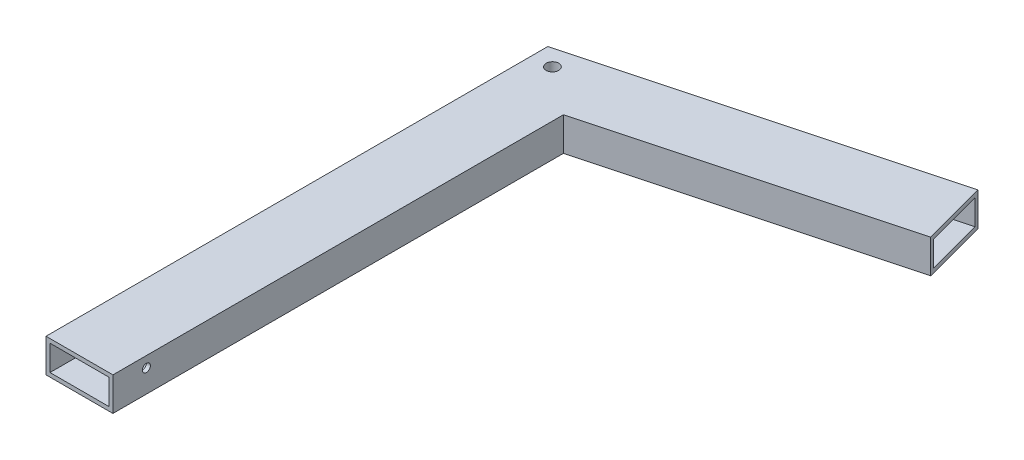
ISO-10303-21;
HEADER;
FILE_DESCRIPTION(('STEP AP214'),'2;1');
FILE_NAME('part.step','',(''),(''),'','','');
FILE_SCHEMA(('AUTOMOTIVE_DESIGN { 1 0 10303 214 1 1 1 1 }'));
ENDSEC;
DATA;
#1=APPLICATION_CONTEXT('core data for automotive mechanical design processes');
#2=APPLICATION_PROTOCOL_DEFINITION('international standard','automotive_design',2000,#1);
#3=PRODUCT_CONTEXT('',#1,'mechanical');
#4=PRODUCT('Part','Part','',(#3));
#5=PRODUCT_RELATED_PRODUCT_CATEGORY('part','',(#4));
#6=PRODUCT_DEFINITION_FORMATION('','',#4);
#7=PRODUCT_DEFINITION_CONTEXT('part definition',#1,'design');
#8=PRODUCT_DEFINITION('design','',#6,#7);
#9=PRODUCT_DEFINITION_SHAPE('','',#8);
#10=(LENGTH_UNIT() NAMED_UNIT(*) SI_UNIT(.MILLI.,.METRE.));
#11=(NAMED_UNIT(*) PLANE_ANGLE_UNIT() SI_UNIT($,.RADIAN.));
#12=(NAMED_UNIT(*) SI_UNIT($,.STERADIAN.) SOLID_ANGLE_UNIT());
#13=UNCERTAINTY_MEASURE_WITH_UNIT(LENGTH_MEASURE(1.E-05),#10,'distance_accuracy_value','');
#14=(GEOMETRIC_REPRESENTATION_CONTEXT(3) GLOBAL_UNCERTAINTY_ASSIGNED_CONTEXT((#13)) GLOBAL_UNIT_ASSIGNED_CONTEXT((#10,
#11,#12)) REPRESENTATION_CONTEXT('',''));
#15=CARTESIAN_POINT('',(0.,0.,0.));
#16=DIRECTION('',(0.,0.,1.));
#17=DIRECTION('',(1.,0.,0.));
#18=AXIS2_PLACEMENT_3D('',#15,#16,#17);
#19=CARTESIAN_POINT('',(-351.987582128705,25.4,-259.527039328841));
#20=DIRECTION('',(-0.965925826289069,0.,0.258819045102517));
#21=DIRECTION('',(-0.258819045102517,0.,-0.965925826289069));
#22=AXIS2_PLACEMENT_3D('',#19,#20,#21);
#23=PLANE('',#22);
#24=DIRECTION('',(0.,-1.,0.));
#25=VECTOR('',#24,1.);
#26=CARTESIAN_POINT('',(-339.628455086968,22.352,-213.40214927188));
#27=LINE('',#26,#25);
#28=CARTESIAN_POINT('',(-339.628455086968,22.352,-213.40214927188));
#29=VERTEX_POINT('',#28);
#30=CARTESIAN_POINT('',(-339.628455086968,3.048,-213.40214927188));
#31=VERTEX_POINT('',#30);
#32=EDGE_CURVE('E168',#29,#31,#27,.T.);
#33=ORIENTED_EDGE('',*,*,#32,.F.);
#34=DIRECTION('',(0.258819045102517,0.,0.965925826289069));
#35=VECTOR('',#34,1.);
#36=CARTESIAN_POINT('',(-351.198701679231,22.352,-256.582897410306));
#37=LINE('',#36,#35);
#38=CARTESIAN_POINT('',(-351.198701679231,22.352,-256.582897410306));
#39=VERTEX_POINT('',#38);
#40=EDGE_CURVE('E175',#39,#29,#37,.T.);
#41=ORIENTED_EDGE('',*,*,#40,.F.);
#42=DIRECTION('',(0.,1.,0.));
#43=VECTOR('',#42,1.);
#44=CARTESIAN_POINT('',(-351.198701679231,22.352,-256.582897410306));
#45=LINE('',#44,#43);
#46=CARTESIAN_POINT('',(-351.198701679231,3.048,-256.582897410306));
#47=VERTEX_POINT('',#46);
#48=EDGE_CURVE('E156',#47,#39,#45,.T.);
#49=ORIENTED_EDGE('',*,*,#48,.F.);
#50=DIRECTION('',(-0.258819045102517,0.,-0.965925826289069));
#51=VECTOR('',#50,1.);
#52=CARTESIAN_POINT('',(-351.198701679231,3.048,-256.582897410306));
#53=LINE('',#52,#51);
#54=EDGE_CURVE('E154',#31,#47,#53,.T.);
#55=ORIENTED_EDGE('',*,*,#54,.F.);
#56=EDGE_LOOP('',(#33,#41,#49,#55));
#57=FACE_BOUND('',#56,.T.);
#58=DIRECTION('',(0.258819045102517,0.,0.965925826289069));
#59=VECTOR('',#58,1.);
#60=CARTESIAN_POINT('',(-351.987582128705,0.,-259.527039328841));
#61=LINE('',#60,#59);
#62=CARTESIAN_POINT('',(-351.987582128705,0.,-259.527039328841));
#63=VERTEX_POINT('',#62);
#64=CARTESIAN_POINT('',(-338.839574637497,0.,-210.458007353357));
#65=VERTEX_POINT('',#64);
#66=EDGE_CURVE('E203',#63,#65,#61,.T.);
#67=ORIENTED_EDGE('',*,*,#66,.F.);
#68=DIRECTION('',(0.,-1.,0.));
#69=VECTOR('',#68,1.);
#70=CARTESIAN_POINT('',(-351.987582128705,25.4,-259.527039328841));
#71=LINE('',#70,#69);
#72=CARTESIAN_POINT('',(-351.987582128705,25.4,-259.527039328841));
#73=VERTEX_POINT('',#72);
#74=EDGE_CURVE('E222',#73,#63,#71,.T.);
#75=ORIENTED_EDGE('',*,*,#74,.F.);
#76=DIRECTION('',(0.258819045102517,0.,0.965925826289069));
#77=VECTOR('',#76,1.);
#78=CARTESIAN_POINT('',(-351.987582128705,25.4,-259.527039328841));
#79=LINE('',#78,#77);
#80=CARTESIAN_POINT('',(-338.839574637497,25.4,-210.458007353357));
#81=VERTEX_POINT('',#80);
#82=EDGE_CURVE('E205',#73,#81,#79,.T.);
#83=ORIENTED_EDGE('',*,*,#82,.T.);
#84=DIRECTION('',(0.,-1.,0.));
#85=VECTOR('',#84,1.);
#86=CARTESIAN_POINT('',(-338.839574637497,25.4,-210.458007353357));
#87=LINE('',#86,#85);
#88=EDGE_CURVE('E11',#81,#65,#87,.T.);
#89=ORIENTED_EDGE('',*,*,#88,.T.);
#90=EDGE_LOOP('',(#67,#75,#83,#89));
#91=FACE_BOUND('',#90,.T.);
#92=ADVANCED_FACE('F37',(#57,#91),#23,.F.);
#93=CARTESIAN_POINT('',(-338.839574637497,25.4,-210.458007353357));
#94=DIRECTION('',(-0.258819045102518,0.,-0.965925826289069));
#95=DIRECTION('',(0.965925826289069,0.,-0.258819045102518));
#96=AXIS2_PLACEMENT_3D('',#93,#94,#95);
#97=PLANE('',#96);
#98=DIRECTION('',(-0.965925826289069,0.,0.258819045102518));
#99=VECTOR('',#98,1.);
#100=CARTESIAN_POINT('',(-338.839574637497,0.,-210.458007353357));
#101=LINE('',#100,#99);
#102=CARTESIAN_POINT('',(-558.8,0.,-151.519789010669));
#103=VERTEX_POINT('',#102);
#104=EDGE_CURVE('E225',#65,#103,#101,.T.);
#105=ORIENTED_EDGE('',*,*,#104,.F.);
#106=ORIENTED_EDGE('',*,*,#88,.F.);
#107=DIRECTION('',(-0.965925826289069,0.,0.258819045102518));
#108=VECTOR('',#107,1.);
#109=CARTESIAN_POINT('',(-338.839574637497,25.4,-210.458007353357));
#110=LINE('',#109,#108);
#111=CARTESIAN_POINT('',(-558.8,25.4,-151.519789010669));
#112=VERTEX_POINT('',#111);
#113=EDGE_CURVE('E208',#81,#112,#110,.T.);
#114=ORIENTED_EDGE('',*,*,#113,.T.);
#115=DIRECTION('',(0.,-1.,0.));
#116=VECTOR('',#115,1.);
#117=CARTESIAN_POINT('',(-558.8,25.4,-151.519789010669));
#118=LINE('',#117,#116);
#119=EDGE_CURVE('E45',#112,#103,#118,.T.);
#120=ORIENTED_EDGE('',*,*,#119,.T.);
#121=EDGE_LOOP('',(#105,#106,#114,#120));
#122=FACE_BOUND('',#121,.T.);
#123=ADVANCED_FACE('F251',(#122),#97,.F.);
#124=CARTESIAN_POINT('',(-558.8,25.4,-151.519789010669));
#125=DIRECTION('',(-1.,0.,0.));
#126=DIRECTION('',(0.,0.,-1.));
#127=AXIS2_PLACEMENT_3D('',#124,#125,#126);
#128=PLANE('',#127);
#129=CARTESIAN_POINT('',(-558.8,17.272,165.1));
#130=DIRECTION('',(1.,0.,0.));
#131=DIRECTION('',(0.,0.,-1.));
#132=AXIS2_PLACEMENT_3D('',#129,#130,#131);
#133=CIRCLE('',#132,3.04800000000001);
#134=CARTESIAN_POINT('',(-558.8,17.272,162.052));
#135=VERTEX_POINT('',#134);
#136=EDGE_CURVE('E296',#135,#135,#133,.T.);
#137=ORIENTED_EDGE('',*,*,#136,.F.);
#138=EDGE_LOOP('',(#137));
#139=FACE_BOUND('',#138,.T.);
#140=DIRECTION('',(0.,0.,1.));
#141=VECTOR('',#140,1.);
#142=CARTESIAN_POINT('',(-558.8,0.,-151.519789010669));
#143=LINE('',#142,#141);
#144=CARTESIAN_POINT('',(-558.8,0.,190.5));
#145=VERTEX_POINT('',#144);
#146=EDGE_CURVE('E228',#103,#145,#143,.T.);
#147=ORIENTED_EDGE('',*,*,#146,.F.);
#148=ORIENTED_EDGE('',*,*,#119,.F.);
#149=DIRECTION('',(0.,0.,1.));
#150=VECTOR('',#149,1.);
#151=CARTESIAN_POINT('',(-558.8,25.4,-151.519789010669));
#152=LINE('',#151,#150);
#153=CARTESIAN_POINT('',(-558.8,25.4,190.5));
#154=VERTEX_POINT('',#153);
#155=EDGE_CURVE('E212',#112,#154,#152,.T.);
#156=ORIENTED_EDGE('',*,*,#155,.T.);
#157=DIRECTION('',(0.,-1.,0.));
#158=VECTOR('',#157,1.);
#159=CARTESIAN_POINT('',(-558.8,25.4,190.5));
#160=LINE('',#159,#158);
#161=EDGE_CURVE('E245',#154,#145,#160,.T.);
#162=ORIENTED_EDGE('',*,*,#161,.T.);
#163=EDGE_LOOP('',(#147,#148,#156,#162));
#164=FACE_BOUND('',#163,.T.);
#165=ADVANCED_FACE('F265',(#139,#164),#128,.F.);
#166=CARTESIAN_POINT('',(-558.8,25.4,190.5));
#167=DIRECTION('',(0.,0.,-1.));
#168=DIRECTION('',(1.,0.,0.));
#169=AXIS2_PLACEMENT_3D('',#166,#167,#168);
#170=PLANE('',#169);
#171=DIRECTION('',(0.,-1.,0.));
#172=VECTOR('',#171,1.);
#173=CARTESIAN_POINT('',(-561.848,22.352,190.5));
#174=LINE('',#173,#172);
#175=CARTESIAN_POINT('',(-561.848,22.352,190.5));
#176=VERTEX_POINT('',#175);
#177=CARTESIAN_POINT('',(-561.848,3.048,190.5));
#178=VERTEX_POINT('',#177);
#179=EDGE_CURVE('E161',#176,#178,#174,.T.);
#180=ORIENTED_EDGE('',*,*,#179,.T.);
#181=DIRECTION('',(-1.,0.,0.));
#182=VECTOR('',#181,1.);
#183=CARTESIAN_POINT('',(-561.848,3.048,190.5));
#184=LINE('',#183,#182);
#185=CARTESIAN_POINT('',(-606.552,3.048,190.5));
#186=VERTEX_POINT('',#185);
#187=EDGE_CURVE('E164',#178,#186,#184,.T.);
#188=ORIENTED_EDGE('',*,*,#187,.T.);
#189=DIRECTION('',(0.,1.,0.));
#190=VECTOR('',#189,1.);
#191=CARTESIAN_POINT('',(-606.552,22.352,190.5));
#192=LINE('',#191,#190);
#193=CARTESIAN_POINT('',(-606.552,22.352,190.5));
#194=VERTEX_POINT('',#193);
#195=EDGE_CURVE('E181',#186,#194,#192,.T.);
#196=ORIENTED_EDGE('',*,*,#195,.T.);
#197=DIRECTION('',(1.,0.,0.));
#198=VECTOR('',#197,1.);
#199=CARTESIAN_POINT('',(-561.848,22.352,190.5));
#200=LINE('',#199,#198);
#201=EDGE_CURVE('E179',#194,#176,#200,.T.);
#202=ORIENTED_EDGE('',*,*,#201,.T.);
#203=EDGE_LOOP('',(#180,#188,#196,#202));
#204=FACE_BOUND('',#203,.T.);
#205=DIRECTION('',(-1.,0.,0.));
#206=VECTOR('',#205,1.);
#207=CARTESIAN_POINT('',(-558.8,0.,190.5));
#208=LINE('',#207,#206);
#209=CARTESIAN_POINT('',(-609.6,0.,190.5));
#210=VERTEX_POINT('',#209);
#211=EDGE_CURVE('E231',#145,#210,#208,.T.);
#212=ORIENTED_EDGE('',*,*,#211,.F.);
#213=ORIENTED_EDGE('',*,*,#161,.F.);
#214=DIRECTION('',(-1.,0.,0.));
#215=VECTOR('',#214,1.);
#216=CARTESIAN_POINT('',(-558.8,25.4,190.5));
#217=LINE('',#216,#215);
#218=CARTESIAN_POINT('',(-609.6,25.4,190.5));
#219=VERTEX_POINT('',#218);
#220=EDGE_CURVE('E215',#154,#219,#217,.T.);
#221=ORIENTED_EDGE('',*,*,#220,.T.);
#222=DIRECTION('',(0.,-1.,0.));
#223=VECTOR('',#222,1.);
#224=CARTESIAN_POINT('',(-609.6,25.4,190.5));
#225=LINE('',#224,#223);
#226=EDGE_CURVE('E242',#219,#210,#225,.T.);
#227=ORIENTED_EDGE('',*,*,#226,.T.);
#228=EDGE_LOOP('',(#212,#213,#221,#227));
#229=FACE_BOUND('',#228,.T.);
#230=ADVANCED_FACE('F267',(#204,#229),#170,.F.);
#231=CARTESIAN_POINT('',(-609.6,25.4,-190.5));
#232=DIRECTION('',(-1.,0.,0.));
#233=DIRECTION('',(0.,0.,-1.));
#234=AXIS2_PLACEMENT_3D('',#231,#232,#233);
#235=PLANE('',#234);
#236=CARTESIAN_POINT('',(-609.6,17.272,165.1));
#237=DIRECTION('',(1.,0.,0.));
#238=DIRECTION('',(0.,0.,-1.));
#239=AXIS2_PLACEMENT_3D('',#236,#237,#238);
#240=CIRCLE('',#239,3.04800000000001);
#241=CARTESIAN_POINT('',(-609.6,17.272,162.052));
#242=VERTEX_POINT('',#241);
#243=EDGE_CURVE('E305',#242,#242,#240,.T.);
#244=ORIENTED_EDGE('',*,*,#243,.T.);
#245=EDGE_LOOP('',(#244));
#246=FACE_BOUND('',#245,.T.);
#247=DIRECTION('',(0.,0.,1.));
#248=VECTOR('',#247,1.);
#249=CARTESIAN_POINT('',(-609.6,0.,-190.5));
#250=LINE('',#249,#248);
#251=CARTESIAN_POINT('',(-609.6,0.,-190.5));
#252=VERTEX_POINT('',#251);
#253=EDGE_CURVE('E234',#252,#210,#250,.T.);
#254=ORIENTED_EDGE('',*,*,#253,.T.);
#255=ORIENTED_EDGE('',*,*,#226,.F.);
#256=DIRECTION('',(0.,0.,1.));
#257=VECTOR('',#256,1.);
#258=CARTESIAN_POINT('',(-609.6,25.4,-190.5));
#259=LINE('',#258,#257);
#260=CARTESIAN_POINT('',(-609.6,25.4,-190.5));
#261=VERTEX_POINT('',#260);
#262=EDGE_CURVE('E218',#261,#219,#259,.T.);
#263=ORIENTED_EDGE('',*,*,#262,.F.);
#264=DIRECTION('',(0.,-1.,0.));
#265=VECTOR('',#264,1.);
#266=CARTESIAN_POINT('',(-609.6,25.4,-190.5));
#267=LINE('',#266,#265);
#268=EDGE_CURVE('E239',#261,#252,#267,.T.);
#269=ORIENTED_EDGE('',*,*,#268,.T.);
#270=EDGE_LOOP('',(#254,#255,#263,#269));
#271=FACE_BOUND('',#270,.T.);
#272=ADVANCED_FACE('F270',(#246,#271),#235,.T.);
#273=CARTESIAN_POINT('',(-609.6,25.4,-190.5));
#274=DIRECTION('',(0.258819045102518,0.,0.965925826289069));
#275=DIRECTION('',(-0.965925826289069,0.,0.258819045102518));
#276=AXIS2_PLACEMENT_3D('',#273,#274,#275);
#277=PLANE('',#276);
#278=DIRECTION('',(0.965925826289069,0.,-0.258819045102518));
#279=VECTOR('',#278,1.);
#280=CARTESIAN_POINT('',(-609.6,0.,-190.5));
#281=LINE('',#280,#279);
#282=EDGE_CURVE('E209',#252,#63,#281,.T.);
#283=ORIENTED_EDGE('',*,*,#282,.F.);
#284=ORIENTED_EDGE('',*,*,#268,.F.);
#285=DIRECTION('',(0.965925826289069,0.,-0.258819045102518));
#286=VECTOR('',#285,1.);
#287=CARTESIAN_POINT('',(-609.6,25.4,-190.5));
#288=LINE('',#287,#286);
#289=EDGE_CURVE('E220',#261,#73,#288,.T.);
#290=ORIENTED_EDGE('',*,*,#289,.T.);
#291=ORIENTED_EDGE('',*,*,#74,.T.);
#292=EDGE_LOOP('',(#283,#284,#290,#291));
#293=FACE_BOUND('',#292,.T.);
#294=ADVANCED_FACE('F273',(#293),#277,.F.);
#295=CARTESIAN_POINT('',(-609.6,25.4,0.));
#296=DIRECTION('',(0.,1.,0.));
#297=DIRECTION('',(0.,0.,1.));
#298=AXIS2_PLACEMENT_3D('',#295,#296,#297);
#299=PLANE('',#298);
#300=CARTESIAN_POINT('',(-594.486618867452,25.4,-178.903094777384));
#301=DIRECTION('',(0.,1.,0.));
#302=DIRECTION('',(0.,0.,-1.));
#303=AXIS2_PLACEMENT_3D('',#300,#301,#302);
#304=CIRCLE('',#303,4.7625);
#305=CARTESIAN_POINT('',(-594.486618867452,25.4,-183.665594777384));
#306=VERTEX_POINT('',#305);
#307=EDGE_CURVE('E308',#306,#306,#304,.T.);
#308=ORIENTED_EDGE('',*,*,#307,.F.);
#309=EDGE_LOOP('',(#308));
#310=FACE_BOUND('',#309,.T.);
#311=ORIENTED_EDGE('',*,*,#82,.F.);
#312=ORIENTED_EDGE('',*,*,#289,.F.);
#313=ORIENTED_EDGE('',*,*,#262,.T.);
#314=ORIENTED_EDGE('',*,*,#220,.F.);
#315=ORIENTED_EDGE('',*,*,#155,.F.);
#316=ORIENTED_EDGE('',*,*,#113,.F.);
#317=EDGE_LOOP('',(#311,#312,#313,#314,#315,#316));
#318=FACE_BOUND('',#317,.T.);
#319=ADVANCED_FACE('F262',(#310,#318),#299,.T.);
#320=CARTESIAN_POINT('',(-609.6,0.,0.));
#321=DIRECTION('',(0.,1.,0.));
#322=DIRECTION('',(0.,0.,1.));
#323=AXIS2_PLACEMENT_3D('',#320,#321,#322);
#324=PLANE('',#323);
#325=CARTESIAN_POINT('',(-594.486618867452,0.,-178.903094777384));
#326=DIRECTION('',(0.,1.,0.));
#327=DIRECTION('',(0.,0.,-1.));
#328=AXIS2_PLACEMENT_3D('',#325,#326,#327);
#329=CIRCLE('',#328,4.7625);
#330=CARTESIAN_POINT('',(-594.486618867452,0.,-183.665594777384));
#331=VERTEX_POINT('',#330);
#332=EDGE_CURVE('E309',#331,#331,#329,.T.);
#333=ORIENTED_EDGE('',*,*,#332,.T.);
#334=EDGE_LOOP('',(#333));
#335=FACE_BOUND('',#334,.T.);
#336=ORIENTED_EDGE('',*,*,#66,.T.);
#337=ORIENTED_EDGE('',*,*,#104,.T.);
#338=ORIENTED_EDGE('',*,*,#146,.T.);
#339=ORIENTED_EDGE('',*,*,#211,.T.);
#340=ORIENTED_EDGE('',*,*,#253,.F.);
#341=ORIENTED_EDGE('',*,*,#282,.T.);
#342=EDGE_LOOP('',(#336,#337,#338,#339,#340,#341));
#343=FACE_BOUND('',#342,.T.);
#344=ADVANCED_FACE('F255',(#335,#343),#324,.F.);
#345=CARTESIAN_POINT('',(-338.839574637497,25.4,-210.458007353357));
#346=DIRECTION('',(-0.258819045102518,0.,-0.965925826289069));
#347=DIRECTION('',(0.965925826289069,0.,-0.258819045102518));
#348=AXIS2_PLACEMENT_3D('',#345,#346,#347);
#349=PLANE('',#348);
#350=DIRECTION('',(0.,-1.,0.));
#351=VECTOR('',#350,1.);
#352=CARTESIAN_POINT('',(-561.848,22.352,-150.703079872139));
#353=LINE('',#352,#351);
#354=CARTESIAN_POINT('',(-561.848,22.352,-150.703079872139));
#355=VERTEX_POINT('',#354);
#356=CARTESIAN_POINT('',(-561.848,3.048,-150.703079872139));
#357=VERTEX_POINT('',#356);
#358=EDGE_CURVE('E188',#355,#357,#353,.T.);
#359=ORIENTED_EDGE('',*,*,#358,.F.);
#360=DIRECTION('',(0.965925826289069,0.,-0.258819045102518));
#361=VECTOR('',#360,1.);
#362=CARTESIAN_POINT('',(-560.788773242841,22.352,-150.986898826321));
#363=LINE('',#362,#361);
#364=CARTESIAN_POINT('',(-606.552,22.352,-138.724679173698));
#365=VERTEX_POINT('',#364);
#366=EDGE_CURVE('E180',#365,#355,#363,.T.);
#367=ORIENTED_EDGE('',*,*,#366,.F.);
#368=DIRECTION('',(0.,1.,0.));
#369=VECTOR('',#368,1.);
#370=CARTESIAN_POINT('',(-606.552,22.352,-138.724679173698));
#371=LINE('',#370,#369);
#372=CARTESIAN_POINT('',(-606.552,3.048,-138.724679173698));
#373=VERTEX_POINT('',#372);
#374=EDGE_CURVE('E197',#373,#365,#371,.T.);
#375=ORIENTED_EDGE('',*,*,#374,.F.);
#376=DIRECTION('',(-0.965925826289069,0.,0.258819045102518));
#377=VECTOR('',#376,1.);
#378=CARTESIAN_POINT('',(-560.788773242841,3.048,-150.986898826321));
#379=LINE('',#378,#377);
#380=EDGE_CURVE('E193',#357,#373,#379,.T.);
#381=ORIENTED_EDGE('',*,*,#380,.F.);
#382=EDGE_LOOP('',(#359,#367,#375,#381));
#383=FACE_BOUND('',#382,.T.);
#384=ADVANCED_FACE('F323',(#383),#349,.F.);
#385=CARTESIAN_POINT('',(-561.848,22.352,-154.939986900775));
#386=DIRECTION('',(0.,1.,0.));
#387=DIRECTION('',(0.,0.,1.));
#388=AXIS2_PLACEMENT_3D('',#385,#386,#387);
#389=PLANE('',#388);
#390=DIRECTION('',(0.,0.,1.));
#391=VECTOR('',#390,1.);
#392=CARTESIAN_POINT('',(-606.552,22.352,-154.939986900775));
#393=LINE('',#392,#391);
#394=EDGE_CURVE('E196',#365,#194,#393,.T.);
#395=ORIENTED_EDGE('',*,*,#394,.F.);
#396=ORIENTED_EDGE('',*,*,#366,.T.);
#397=DIRECTION('',(0.,0.,1.));
#398=VECTOR('',#397,1.);
#399=CARTESIAN_POINT('',(-561.848,22.352,-154.939986900775));
#400=LINE('',#399,#398);
#401=EDGE_CURVE('E60',#355,#176,#400,.T.);
#402=ORIENTED_EDGE('',*,*,#401,.T.);
#403=ORIENTED_EDGE('',*,*,#201,.F.);
#404=EDGE_LOOP('',(#395,#396,#402,#403));
#405=FACE_BOUND('',#404,.T.);
#406=ADVANCED_FACE('F327',(#405),#389,.F.);
#407=CARTESIAN_POINT('',(-606.552,22.352,-154.939986900775));
#408=DIRECTION('',(-1.,0.,0.));
#409=DIRECTION('',(0.,0.,-1.));
#410=AXIS2_PLACEMENT_3D('',#407,#408,#409);
#411=PLANE('',#410);
#412=CARTESIAN_POINT('',(-606.552,17.272,165.1));
#413=DIRECTION('',(1.,0.,0.));
#414=DIRECTION('',(0.,0.,-1.));
#415=AXIS2_PLACEMENT_3D('',#412,#413,#414);
#416=CIRCLE('',#415,3.04800000000001);
#417=CARTESIAN_POINT('',(-606.552,17.272,162.052));
#418=VERTEX_POINT('',#417);
#419=EDGE_CURVE('E299',#418,#418,#416,.T.);
#420=ORIENTED_EDGE('',*,*,#419,.F.);
#421=EDGE_LOOP('',(#420));
#422=FACE_BOUND('',#421,.T.);
#423=DIRECTION('',(0.,0.,1.));
#424=VECTOR('',#423,1.);
#425=CARTESIAN_POINT('',(-606.552,3.048,-154.939986900775));
#426=LINE('',#425,#424);
#427=EDGE_CURVE('E192',#373,#186,#426,.T.);
#428=ORIENTED_EDGE('',*,*,#427,.F.);
#429=ORIENTED_EDGE('',*,*,#374,.T.);
#430=ORIENTED_EDGE('',*,*,#394,.T.);
#431=ORIENTED_EDGE('',*,*,#195,.F.);
#432=EDGE_LOOP('',(#428,#429,#430,#431));
#433=FACE_BOUND('',#432,.T.);
#434=ADVANCED_FACE('F333',(#422,#433),#411,.F.);
#435=CARTESIAN_POINT('',(-561.848,3.048,-154.939986900775));
#436=DIRECTION('',(0.,-1.,0.));
#437=DIRECTION('',(0.,0.,-1.));
#438=AXIS2_PLACEMENT_3D('',#435,#436,#437);
#439=PLANE('',#438);
#440=DIRECTION('',(0.,0.,1.));
#441=VECTOR('',#440,1.);
#442=CARTESIAN_POINT('',(-561.848,3.048,-154.939986900775));
#443=LINE('',#442,#441);
#444=EDGE_CURVE('E191',#357,#178,#443,.T.);
#445=ORIENTED_EDGE('',*,*,#444,.F.);
#446=ORIENTED_EDGE('',*,*,#380,.T.);
#447=ORIENTED_EDGE('',*,*,#427,.T.);
#448=ORIENTED_EDGE('',*,*,#187,.F.);
#449=EDGE_LOOP('',(#445,#446,#447,#448));
#450=FACE_BOUND('',#449,.T.);
#451=ADVANCED_FACE('F336',(#450),#439,.F.);
#452=CARTESIAN_POINT('',(-561.848,22.352,-154.939986900775));
#453=DIRECTION('',(1.,0.,0.));
#454=DIRECTION('',(0.,0.,1.));
#455=AXIS2_PLACEMENT_3D('',#452,#453,#454);
#456=PLANE('',#455);
#457=CARTESIAN_POINT('',(-561.848,17.272,165.1));
#458=DIRECTION('',(-1.,0.,0.));
#459=DIRECTION('',(0.,0.,1.));
#460=AXIS2_PLACEMENT_3D('',#457,#458,#459);
#461=CIRCLE('',#460,3.04800000000001);
#462=CARTESIAN_POINT('',(-561.848,17.272,168.148));
#463=VERTEX_POINT('',#462);
#464=EDGE_CURVE('E40',#463,#463,#461,.T.);
#465=ORIENTED_EDGE('',*,*,#464,.F.);
#466=EDGE_LOOP('',(#465));
#467=FACE_BOUND('',#466,.T.);
#468=ORIENTED_EDGE('',*,*,#401,.F.);
#469=ORIENTED_EDGE('',*,*,#358,.T.);
#470=ORIENTED_EDGE('',*,*,#444,.T.);
#471=ORIENTED_EDGE('',*,*,#179,.F.);
#472=EDGE_LOOP('',(#468,#469,#470,#471));
#473=FACE_BOUND('',#472,.T.);
#474=ADVANCED_FACE('F340',(#467,#473),#456,.F.);
#475=CARTESIAN_POINT('',(-348.999097425604,22.352,-257.172279593733));
#476=DIRECTION('',(0.,-1.,0.));
#477=DIRECTION('',(0.,0.,-1.));
#478=AXIS2_PLACEMENT_3D('',#475,#476,#477);
#479=PLANE('',#478);
#480=DIRECTION('',(0.,0.,1.));
#481=VECTOR('',#480,1.);
#482=CARTESIAN_POINT('',(-558.8,22.352,-257.172279593733));
#483=LINE('',#482,#481);
#484=CARTESIAN_POINT('',(-558.8,22.352,-200.956297177604));
#485=VERTEX_POINT('',#484);
#486=CARTESIAN_POINT('',(-558.8,22.352,-154.675310808552));
#487=VERTEX_POINT('',#486);
#488=EDGE_CURVE('E147',#485,#487,#483,.T.);
#489=ORIENTED_EDGE('',*,*,#488,.F.);
#490=DIRECTION('',(-0.965925826289069,0.,0.258819045102519));
#491=VECTOR('',#490,1.);
#492=CARTESIAN_POINT('',(-348.999097425604,22.352,-257.172279593733));
#493=LINE('',#492,#491);
#494=EDGE_CURVE('E52',#39,#485,#493,.T.);
#495=ORIENTED_EDGE('',*,*,#494,.F.);
#496=ORIENTED_EDGE('',*,*,#40,.T.);
#497=DIRECTION('',(-0.965925826289069,0.,0.258819045102519));
#498=VECTOR('',#497,1.);
#499=CARTESIAN_POINT('',(-337.428850833341,22.352,-213.991531455307));
#500=LINE('',#499,#498);
#501=EDGE_CURVE('E172',#29,#487,#500,.T.);
#502=ORIENTED_EDGE('',*,*,#501,.T.);
#503=EDGE_LOOP('',(#489,#495,#496,#502));
#504=FACE_BOUND('',#503,.T.);
#505=ADVANCED_FACE('F295',(#504),#479,.T.);
#506=CARTESIAN_POINT('',(-337.428850833341,22.352,-213.991531455307));
#507=DIRECTION('',(-0.258819045102519,0.,-0.965925826289069));
#508=DIRECTION('',(0.965925826289069,0.,-0.258819045102519));
#509=AXIS2_PLACEMENT_3D('',#506,#507,#508);
#510=PLANE('',#509);
#511=DIRECTION('',(0.,-1.,0.));
#512=VECTOR('',#511,1.);
#513=CARTESIAN_POINT('',(-558.8,22.352,-154.675310808552));
#514=LINE('',#513,#512);
#515=CARTESIAN_POINT('',(-558.8,3.048,-154.675310808552));
#516=VERTEX_POINT('',#515);
#517=EDGE_CURVE('E160',#487,#516,#514,.T.);
#518=ORIENTED_EDGE('',*,*,#517,.F.);
#519=ORIENTED_EDGE('',*,*,#501,.F.);
#520=ORIENTED_EDGE('',*,*,#32,.T.);
#521=DIRECTION('',(-0.965925826289069,0.,0.258819045102519));
#522=VECTOR('',#521,1.);
#523=CARTESIAN_POINT('',(-337.428850833341,3.048,-213.991531455307));
#524=LINE('',#523,#522);
#525=EDGE_CURVE('E176',#31,#516,#524,.T.);
#526=ORIENTED_EDGE('',*,*,#525,.T.);
#527=EDGE_LOOP('',(#518,#519,#520,#526));
#528=FACE_BOUND('',#527,.T.);
#529=ADVANCED_FACE('F294',(#528),#510,.T.);
#530=CARTESIAN_POINT('',(-348.999097425604,3.048,-257.172279593733));
#531=DIRECTION('',(0.,1.,0.));
#532=DIRECTION('',(0.,0.,1.));
#533=AXIS2_PLACEMENT_3D('',#530,#531,#532);
#534=PLANE('',#533);
#535=DIRECTION('',(0.,0.,-1.));
#536=VECTOR('',#535,1.);
#537=CARTESIAN_POINT('',(-558.8,3.048,-257.172279593733));
#538=LINE('',#537,#536);
#539=CARTESIAN_POINT('',(-558.8,3.048,-200.956297177604));
#540=VERTEX_POINT('',#539);
#541=EDGE_CURVE('E151',#516,#540,#538,.T.);
#542=ORIENTED_EDGE('',*,*,#541,.F.);
#543=ORIENTED_EDGE('',*,*,#525,.F.);
#544=ORIENTED_EDGE('',*,*,#54,.T.);
#545=DIRECTION('',(-0.965925826289069,0.,0.258819045102519));
#546=VECTOR('',#545,1.);
#547=CARTESIAN_POINT('',(-348.999097425604,3.048,-257.172279593733));
#548=LINE('',#547,#546);
#549=EDGE_CURVE('E142',#47,#540,#548,.T.);
#550=ORIENTED_EDGE('',*,*,#549,.T.);
#551=EDGE_LOOP('',(#542,#543,#544,#550));
#552=FACE_BOUND('',#551,.T.);
#553=ADVANCED_FACE('F150',(#552),#534,.T.);
#554=CARTESIAN_POINT('',(-348.999097425604,22.352,-257.172279593733));
#555=DIRECTION('',(0.258819045102519,0.,0.965925826289069));
#556=DIRECTION('',(-0.965925826289069,0.,0.258819045102519));
#557=AXIS2_PLACEMENT_3D('',#554,#555,#556);
#558=PLANE('',#557);
#559=DIRECTION('',(0.,1.,0.));
#560=VECTOR('',#559,1.);
#561=CARTESIAN_POINT('',(-558.8,22.352,-200.956297177604));
#562=LINE('',#561,#560);
#563=EDGE_CURVE('E139',#540,#485,#562,.T.);
#564=ORIENTED_EDGE('',*,*,#563,.F.);
#565=ORIENTED_EDGE('',*,*,#549,.F.);
#566=ORIENTED_EDGE('',*,*,#48,.T.);
#567=ORIENTED_EDGE('',*,*,#494,.T.);
#568=EDGE_LOOP('',(#564,#565,#566,#567));
#569=FACE_BOUND('',#568,.T.);
#570=ADVANCED_FACE('F141',(#569),#558,.T.);
#571=CARTESIAN_POINT('',(-558.8,25.4,-151.519789010669));
#572=DIRECTION('',(-1.,0.,0.));
#573=DIRECTION('',(0.,0.,-1.));
#574=AXIS2_PLACEMENT_3D('',#571,#572,#573);
#575=PLANE('',#574);
#576=ORIENTED_EDGE('',*,*,#563,.T.);
#577=ORIENTED_EDGE('',*,*,#488,.T.);
#578=ORIENTED_EDGE('',*,*,#517,.T.);
#579=ORIENTED_EDGE('',*,*,#541,.T.);
#580=EDGE_LOOP('',(#576,#577,#578,#579));
#581=FACE_BOUND('',#580,.T.);
#582=ADVANCED_FACE('F159',(#581),#575,.F.);
#583=CARTESIAN_POINT('',(-495.3,17.272,165.1));
#584=DIRECTION('',(-1.,0.,0.));
#585=DIRECTION('',(0.,0.,-1.));
#586=AXIS2_PLACEMENT_3D('',#583,#584,#585);
#587=CYLINDRICAL_SURFACE('',#586,3.04800000000001);
#588=ORIENTED_EDGE('',*,*,#464,.T.);
#589=EDGE_LOOP('',(#588));
#590=FACE_BOUND('',#589,.T.);
#591=ORIENTED_EDGE('',*,*,#136,.T.);
#592=EDGE_LOOP('',(#591));
#593=FACE_BOUND('',#592,.T.);
#594=ADVANCED_FACE('F347',(#590,#593),#587,.F.);
#595=ORIENTED_EDGE('',*,*,#243,.F.);
#596=EDGE_LOOP('',(#595));
#597=FACE_BOUND('',#596,.T.);
#598=ORIENTED_EDGE('',*,*,#419,.T.);
#599=EDGE_LOOP('',(#598));
#600=FACE_BOUND('',#599,.T.);
#601=ADVANCED_FACE('F318',(#597,#600),#587,.F.);
#602=CARTESIAN_POINT('',(-594.486618867452,25.4,-178.903094777384));
#603=DIRECTION('',(0.,-1.,0.));
#604=DIRECTION('',(0.,0.,-1.));
#605=AXIS2_PLACEMENT_3D('',#602,#603,#604);
#606=CYLINDRICAL_SURFACE('',#605,4.7625);
#607=ORIENTED_EDGE('',*,*,#307,.T.);
#608=EDGE_LOOP('',(#607));
#609=FACE_BOUND('',#608,.T.);
#610=ORIENTED_EDGE('',*,*,#332,.F.);
#611=EDGE_LOOP('',(#610));
#612=FACE_BOUND('',#611,.T.);
#613=ADVANCED_FACE('F315',(#609,#612),#606,.F.);
#614=CLOSED_SHELL('',(#92,#123,#165,#230,#272,#294,#319,#344,#384,#406,#434,#451,#474,#505,#529,
#553,#570,#582,#594,#601,#613));
#615=MANIFOLD_SOLID_BREP('B2',#614);
#616=ADVANCED_BREP_SHAPE_REPRESENTATION('',(#18,#615),#14);
#617=SHAPE_DEFINITION_REPRESENTATION(#9,#616);
ENDSEC;
END-ISO-10303-21;
